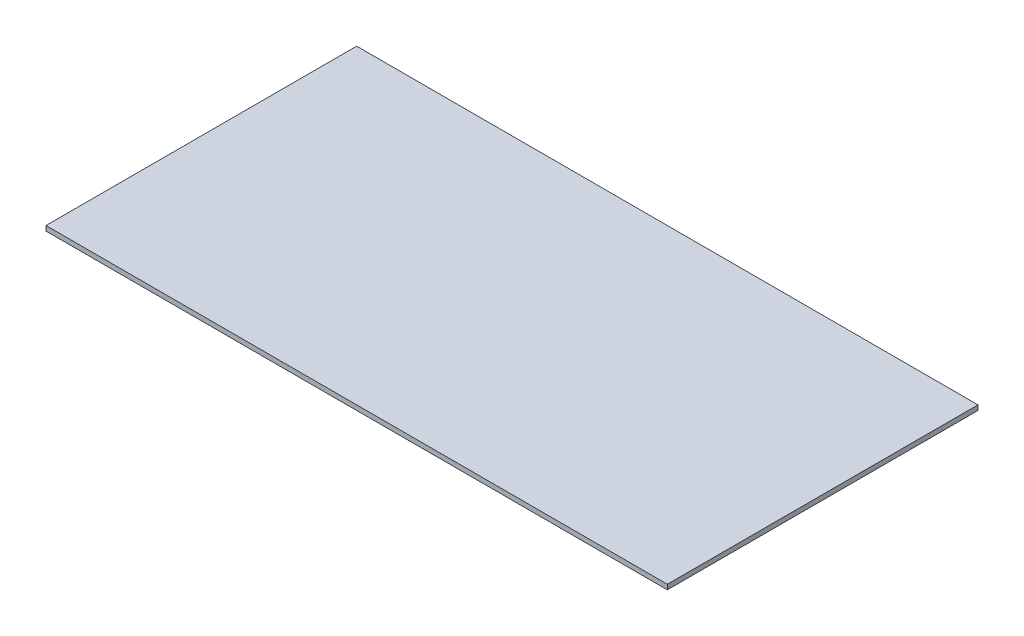
ISO-10303-21;
HEADER;
FILE_DESCRIPTION(('STEP AP214'),'2;1');
FILE_NAME('part.step','',(''),(''),'','','');
FILE_SCHEMA(('AUTOMOTIVE_DESIGN { 1 0 10303 214 1 1 1 1 }'));
ENDSEC;
DATA;
#1=APPLICATION_CONTEXT('core data for automotive mechanical design processes');
#2=APPLICATION_PROTOCOL_DEFINITION('international standard','automotive_design',2000,#1);
#3=PRODUCT_CONTEXT('',#1,'mechanical');
#4=PRODUCT('Part','Part','',(#3));
#5=PRODUCT_RELATED_PRODUCT_CATEGORY('part','',(#4));
#6=PRODUCT_DEFINITION_FORMATION('','',#4);
#7=PRODUCT_DEFINITION_CONTEXT('part definition',#1,'design');
#8=PRODUCT_DEFINITION('design','',#6,#7);
#9=PRODUCT_DEFINITION_SHAPE('','',#8);
#10=(LENGTH_UNIT() NAMED_UNIT(*) SI_UNIT(.MILLI.,.METRE.));
#11=(NAMED_UNIT(*) PLANE_ANGLE_UNIT() SI_UNIT($,.RADIAN.));
#12=(NAMED_UNIT(*) SI_UNIT($,.STERADIAN.) SOLID_ANGLE_UNIT());
#13=UNCERTAINTY_MEASURE_WITH_UNIT(LENGTH_MEASURE(1.E-05),#10,'distance_accuracy_value','');
#14=(GEOMETRIC_REPRESENTATION_CONTEXT(3) GLOBAL_UNCERTAINTY_ASSIGNED_CONTEXT((#13)) GLOBAL_UNIT_ASSIGNED_CONTEXT((#10,
#11,#12)) REPRESENTATION_CONTEXT('',''));
#15=CARTESIAN_POINT('',(0.,0.,0.));
#16=DIRECTION('',(0.,0.,1.));
#17=DIRECTION('',(1.,0.,0.));
#18=AXIS2_PLACEMENT_3D('',#15,#16,#17);
#19=CARTESIAN_POINT('',(0.,3.175,0.));
#20=DIRECTION('',(0.,1.,0.));
#21=DIRECTION('',(0.,0.,1.));
#22=AXIS2_PLACEMENT_3D('',#19,#20,#21);
#23=PLANE('',#22);
#24=DIRECTION('',(-1.,0.,0.));
#25=VECTOR('',#24,1.);
#26=CARTESIAN_POINT('',(203.2,3.175,-101.6));
#27=LINE('',#26,#25);
#28=CARTESIAN_POINT('',(-203.2,3.175,-101.6));
#29=VERTEX_POINT('',#28);
#30=CARTESIAN_POINT('',(203.2,3.175,-101.6));
#31=VERTEX_POINT('',#30);
#32=EDGE_CURVE('E68',#29,#31,#27,.F.);
#33=ORIENTED_EDGE('',*,*,#32,.F.);
#34=DIRECTION('',(0.,0.,1.));
#35=VECTOR('',#34,1.);
#36=CARTESIAN_POINT('',(-203.2,3.175,-101.6));
#37=LINE('',#36,#35);
#38=CARTESIAN_POINT('',(-203.2,3.175,101.6));
#39=VERTEX_POINT('',#38);
#40=EDGE_CURVE('E20',#39,#29,#37,.F.);
#41=ORIENTED_EDGE('',*,*,#40,.F.);
#42=DIRECTION('',(1.,0.,0.));
#43=VECTOR('',#42,1.);
#44=CARTESIAN_POINT('',(-203.2,3.175,101.6));
#45=LINE('',#44,#43);
#46=CARTESIAN_POINT('',(203.2,3.175,101.6));
#47=VERTEX_POINT('',#46);
#48=EDGE_CURVE('E58',#47,#39,#45,.F.);
#49=ORIENTED_EDGE('',*,*,#48,.F.);
#50=DIRECTION('',(0.,0.,-1.));
#51=VECTOR('',#50,1.);
#52=CARTESIAN_POINT('',(203.2,3.175,101.6));
#53=LINE('',#52,#51);
#54=EDGE_CURVE('E53',#31,#47,#53,.F.);
#55=ORIENTED_EDGE('',*,*,#54,.F.);
#56=EDGE_LOOP('',(#33,#41,#49,#55));
#57=FACE_BOUND('',#56,.T.);
#58=ADVANCED_FACE('F17',(#57),#23,.T.);
#59=CARTESIAN_POINT('',(-203.2,0.,-101.6));
#60=DIRECTION('',(-1.,0.,0.));
#61=DIRECTION('',(0.,0.,1.));
#62=AXIS2_PLACEMENT_3D('',#59,#60,#61);
#63=PLANE('',#62);
#64=DIRECTION('',(0.,1.,0.));
#65=VECTOR('',#64,1.);
#66=CARTESIAN_POINT('',(-203.2,0.,-101.6));
#67=LINE('',#66,#65);
#68=CARTESIAN_POINT('',(-203.2,0.,-101.6));
#69=VERTEX_POINT('',#68);
#70=EDGE_CURVE('E79',#69,#29,#67,.T.);
#71=ORIENTED_EDGE('',*,*,#70,.F.);
#72=DIRECTION('',(0.,0.,1.));
#73=VECTOR('',#72,1.);
#74=CARTESIAN_POINT('',(-203.2,0.,0.));
#75=LINE('',#74,#73);
#76=CARTESIAN_POINT('',(-203.2,0.,101.6));
#77=VERTEX_POINT('',#76);
#78=EDGE_CURVE('E74',#69,#77,#75,.T.);
#79=ORIENTED_EDGE('',*,*,#78,.T.);
#80=DIRECTION('',(0.,1.,0.));
#81=VECTOR('',#80,1.);
#82=CARTESIAN_POINT('',(-203.2,0.,101.6));
#83=LINE('',#82,#81);
#84=EDGE_CURVE('E63',#39,#77,#83,.F.);
#85=ORIENTED_EDGE('',*,*,#84,.F.);
#86=ORIENTED_EDGE('',*,*,#40,.T.);
#87=EDGE_LOOP('',(#71,#79,#85,#86));
#88=FACE_BOUND('',#87,.T.);
#89=ADVANCED_FACE('F73',(#88),#63,.T.);
#90=CARTESIAN_POINT('',(-203.2,0.,101.6));
#91=DIRECTION('',(0.,0.,1.));
#92=DIRECTION('',(1.,0.,0.));
#93=AXIS2_PLACEMENT_3D('',#90,#91,#92);
#94=PLANE('',#93);
#95=ORIENTED_EDGE('',*,*,#84,.T.);
#96=DIRECTION('',(1.,0.,0.));
#97=VECTOR('',#96,1.);
#98=CARTESIAN_POINT('',(0.,0.,101.6));
#99=LINE('',#98,#97);
#100=CARTESIAN_POINT('',(203.2,0.,101.6));
#101=VERTEX_POINT('',#100);
#102=EDGE_CURVE('E84',#77,#101,#99,.T.);
#103=ORIENTED_EDGE('',*,*,#102,.T.);
#104=DIRECTION('',(0.,1.,0.));
#105=VECTOR('',#104,1.);
#106=CARTESIAN_POINT('',(203.2,0.,101.6));
#107=LINE('',#106,#105);
#108=EDGE_CURVE('E65',#47,#101,#107,.F.);
#109=ORIENTED_EDGE('',*,*,#108,.F.);
#110=ORIENTED_EDGE('',*,*,#48,.T.);
#111=EDGE_LOOP('',(#95,#103,#109,#110));
#112=FACE_BOUND('',#111,.T.);
#113=ADVANCED_FACE('F60',(#112),#94,.T.);
#114=CARTESIAN_POINT('',(203.2,0.,101.6));
#115=DIRECTION('',(1.,0.,0.));
#116=DIRECTION('',(0.,0.,-1.));
#117=AXIS2_PLACEMENT_3D('',#114,#115,#116);
#118=PLANE('',#117);
#119=ORIENTED_EDGE('',*,*,#108,.T.);
#120=DIRECTION('',(0.,0.,1.));
#121=VECTOR('',#120,1.);
#122=CARTESIAN_POINT('',(203.2,0.,0.));
#123=LINE('',#122,#121);
#124=CARTESIAN_POINT('',(203.2,0.,-101.6));
#125=VERTEX_POINT('',#124);
#126=EDGE_CURVE('E26',#101,#125,#123,.F.);
#127=ORIENTED_EDGE('',*,*,#126,.T.);
#128=DIRECTION('',(0.,1.,0.));
#129=VECTOR('',#128,1.);
#130=CARTESIAN_POINT('',(203.2,0.,-101.6));
#131=LINE('',#130,#129);
#132=EDGE_CURVE('E34',#31,#125,#131,.F.);
#133=ORIENTED_EDGE('',*,*,#132,.F.);
#134=ORIENTED_EDGE('',*,*,#54,.T.);
#135=EDGE_LOOP('',(#119,#127,#133,#134));
#136=FACE_BOUND('',#135,.T.);
#137=ADVANCED_FACE('F88',(#136),#118,.T.);
#138=CARTESIAN_POINT('',(203.2,0.,-101.6));
#139=DIRECTION('',(0.,0.,-1.));
#140=DIRECTION('',(-1.,0.,0.));
#141=AXIS2_PLACEMENT_3D('',#138,#139,#140);
#142=PLANE('',#141);
#143=ORIENTED_EDGE('',*,*,#132,.T.);
#144=DIRECTION('',(1.,0.,0.));
#145=VECTOR('',#144,1.);
#146=CARTESIAN_POINT('',(0.,0.,-101.6));
#147=LINE('',#146,#145);
#148=EDGE_CURVE('E11',#125,#69,#147,.F.);
#149=ORIENTED_EDGE('',*,*,#148,.T.);
#150=ORIENTED_EDGE('',*,*,#70,.T.);
#151=ORIENTED_EDGE('',*,*,#32,.T.);
#152=EDGE_LOOP('',(#143,#149,#150,#151));
#153=FACE_BOUND('',#152,.T.);
#154=ADVANCED_FACE('F91',(#153),#142,.T.);
#155=CARTESIAN_POINT('',(0.,0.,0.));
#156=DIRECTION('',(0.,1.,0.));
#157=DIRECTION('',(0.,0.,1.));
#158=AXIS2_PLACEMENT_3D('',#155,#156,#157);
#159=PLANE('',#158);
#160=ORIENTED_EDGE('',*,*,#126,.F.);
#161=ORIENTED_EDGE('',*,*,#102,.F.);
#162=ORIENTED_EDGE('',*,*,#78,.F.);
#163=ORIENTED_EDGE('',*,*,#148,.F.);
#164=EDGE_LOOP('',(#160,#161,#162,#163));
#165=FACE_BOUND('',#164,.T.);
#166=ADVANCED_FACE('F90',(#165),#159,.F.);
#167=CLOSED_SHELL('',(#58,#89,#113,#137,#154,#166));
#168=MANIFOLD_SOLID_BREP('B1',#167);
#169=ADVANCED_BREP_SHAPE_REPRESENTATION('',(#18,#168),#14);
#170=SHAPE_DEFINITION_REPRESENTATION(#9,#169);
ENDSEC;
END-ISO-10303-21;
